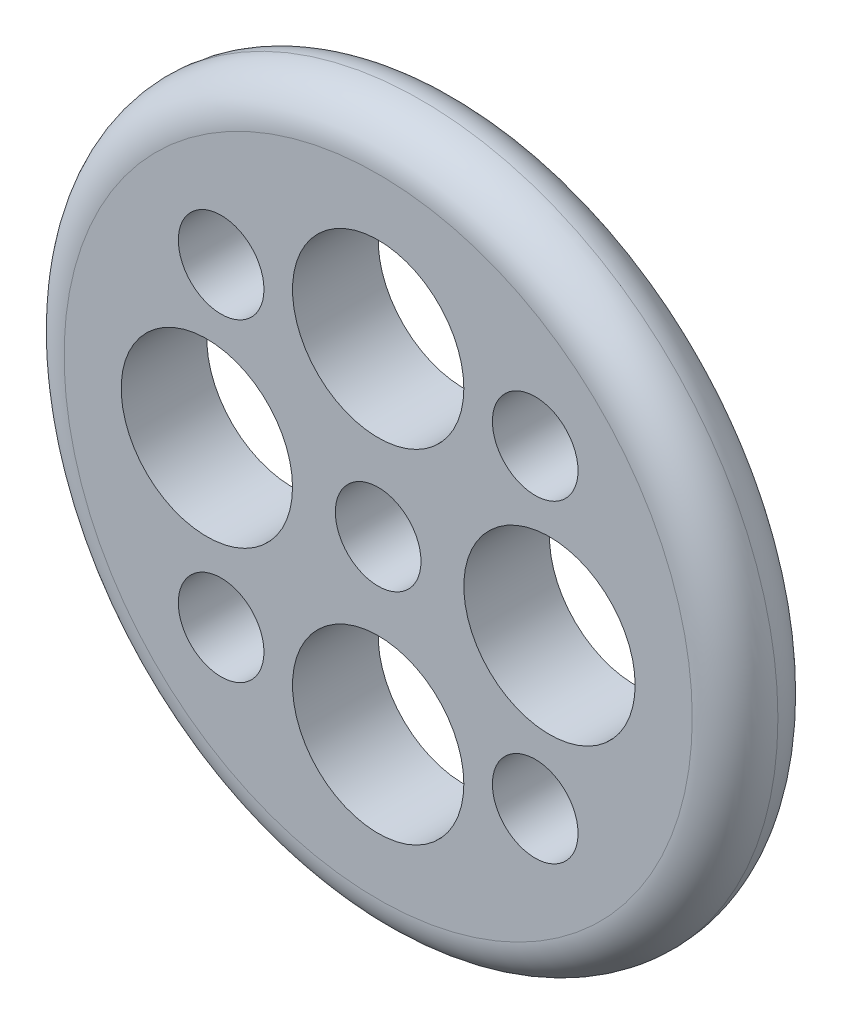
ISO-10303-21;
HEADER;
FILE_DESCRIPTION(('STEP AP214'),'2;1');
FILE_NAME('part.step','',(''),(''),'','','');
FILE_SCHEMA(('AUTOMOTIVE_DESIGN { 1 0 10303 214 1 1 1 1 }'));
ENDSEC;
DATA;
#1=APPLICATION_CONTEXT('core data for automotive mechanical design processes');
#2=APPLICATION_PROTOCOL_DEFINITION('international standard','automotive_design',2000,#1);
#3=PRODUCT_CONTEXT('',#1,'mechanical');
#4=PRODUCT('Part','Part','',(#3));
#5=PRODUCT_RELATED_PRODUCT_CATEGORY('part','',(#4));
#6=PRODUCT_DEFINITION_FORMATION('','',#4);
#7=PRODUCT_DEFINITION_CONTEXT('part definition',#1,'design');
#8=PRODUCT_DEFINITION('design','',#6,#7);
#9=PRODUCT_DEFINITION_SHAPE('','',#8);
#10=(LENGTH_UNIT() NAMED_UNIT(*) SI_UNIT(.MILLI.,.METRE.));
#11=(NAMED_UNIT(*) PLANE_ANGLE_UNIT() SI_UNIT($,.RADIAN.));
#12=(NAMED_UNIT(*) SI_UNIT($,.STERADIAN.) SOLID_ANGLE_UNIT());
#13=UNCERTAINTY_MEASURE_WITH_UNIT(LENGTH_MEASURE(1.E-05),#10,'distance_accuracy_value','');
#14=(GEOMETRIC_REPRESENTATION_CONTEXT(3) GLOBAL_UNCERTAINTY_ASSIGNED_CONTEXT((#13)) GLOBAL_UNIT_ASSIGNED_CONTEXT((#10,
#11,#12)) REPRESENTATION_CONTEXT('',''));
#15=CARTESIAN_POINT('',(0.,0.,0.));
#16=DIRECTION('',(0.,0.,1.));
#17=DIRECTION('',(1.,0.,0.));
#18=AXIS2_PLACEMENT_3D('',#15,#16,#17);
#19=CARTESIAN_POINT('',(0.,0.,30.));
#20=DIRECTION('',(0.,0.,1.));
#21=DIRECTION('',(1.,0.,0.));
#22=AXIS2_PLACEMENT_3D('',#19,#20,#21);
#23=PLANE('',#22);
#24=CARTESIAN_POINT('',(55.,-55.,30.));
#25=DIRECTION('',(0.,0.,1.));
#26=DIRECTION('',(1.,0.,0.));
#27=AXIS2_PLACEMENT_3D('',#24,#25,#26);
#28=CIRCLE('',#27,15.);
#29=CARTESIAN_POINT('',(70.,-55.,30.));
#30=VERTEX_POINT('',#29);
#31=EDGE_CURVE('E107',#30,#30,#28,.T.);
#32=ORIENTED_EDGE('',*,*,#31,.F.);
#33=EDGE_LOOP('',(#32));
#34=FACE_BOUND('',#33,.T.);
#35=CARTESIAN_POINT('',(60.,0.,30.));
#36=DIRECTION('',(0.,0.,1.));
#37=DIRECTION('',(1.,0.,0.));
#38=AXIS2_PLACEMENT_3D('',#35,#36,#37);
#39=CIRCLE('',#38,30.);
#40=CARTESIAN_POINT('',(90.,0.,30.));
#41=VERTEX_POINT('',#40);
#42=EDGE_CURVE('E106',#41,#41,#39,.T.);
#43=ORIENTED_EDGE('',*,*,#42,.F.);
#44=EDGE_LOOP('',(#43));
#45=FACE_BOUND('',#44,.T.);
#46=CARTESIAN_POINT('',(-60.,0.,30.));
#47=DIRECTION('',(0.,0.,1.));
#48=DIRECTION('',(1.,0.,0.));
#49=AXIS2_PLACEMENT_3D('',#46,#47,#48);
#50=CIRCLE('',#49,30.);
#51=CARTESIAN_POINT('',(-30.,0.,30.));
#52=VERTEX_POINT('',#51);
#53=EDGE_CURVE('E100',#52,#52,#50,.T.);
#54=ORIENTED_EDGE('',*,*,#53,.F.);
#55=EDGE_LOOP('',(#54));
#56=FACE_BOUND('',#55,.T.);
#57=CARTESIAN_POINT('',(0.,-60.,30.));
#58=DIRECTION('',(0.,0.,1.));
#59=DIRECTION('',(1.,0.,0.));
#60=AXIS2_PLACEMENT_3D('',#57,#58,#59);
#61=CIRCLE('',#60,30.);
#62=CARTESIAN_POINT('',(30.,-60.,30.));
#63=VERTEX_POINT('',#62);
#64=EDGE_CURVE('E103',#63,#63,#61,.T.);
#65=ORIENTED_EDGE('',*,*,#64,.F.);
#66=EDGE_LOOP('',(#65));
#67=FACE_BOUND('',#66,.T.);
#68=CARTESIAN_POINT('',(-55.,-55.,30.));
#69=DIRECTION('',(0.,0.,1.));
#70=DIRECTION('',(1.,0.,0.));
#71=AXIS2_PLACEMENT_3D('',#68,#69,#70);
#72=CIRCLE('',#71,15.);
#73=CARTESIAN_POINT('',(-40.,-55.,30.));
#74=VERTEX_POINT('',#73);
#75=EDGE_CURVE('E110',#74,#74,#72,.T.);
#76=ORIENTED_EDGE('',*,*,#75,.F.);
#77=EDGE_LOOP('',(#76));
#78=FACE_BOUND('',#77,.T.);
#79=CARTESIAN_POINT('',(-55.,55.,30.));
#80=DIRECTION('',(0.,0.,1.));
#81=DIRECTION('',(1.,0.,0.));
#82=AXIS2_PLACEMENT_3D('',#79,#80,#81);
#83=CIRCLE('',#82,15.);
#84=CARTESIAN_POINT('',(-40.,55.,30.));
#85=VERTEX_POINT('',#84);
#86=EDGE_CURVE('E116',#85,#85,#83,.T.);
#87=ORIENTED_EDGE('',*,*,#86,.F.);
#88=EDGE_LOOP('',(#87));
#89=FACE_BOUND('',#88,.T.);
#90=CARTESIAN_POINT('',(55.,55.,30.));
#91=DIRECTION('',(0.,0.,1.));
#92=DIRECTION('',(1.,0.,0.));
#93=AXIS2_PLACEMENT_3D('',#90,#91,#92);
#94=CIRCLE('',#93,15.);
#95=CARTESIAN_POINT('',(70.,55.,30.));
#96=VERTEX_POINT('',#95);
#97=EDGE_CURVE('E113',#96,#96,#94,.T.);
#98=ORIENTED_EDGE('',*,*,#97,.F.);
#99=EDGE_LOOP('',(#98));
#100=FACE_BOUND('',#99,.T.);
#101=CARTESIAN_POINT('',(0.,60.,30.));
#102=DIRECTION('',(0.,0.,1.));
#103=DIRECTION('',(1.,0.,0.));
#104=AXIS2_PLACEMENT_3D('',#101,#102,#103);
#105=CIRCLE('',#104,30.);
#106=CARTESIAN_POINT('',(30.,60.,30.));
#107=VERTEX_POINT('',#106);
#108=EDGE_CURVE('E70',#107,#107,#105,.T.);
#109=ORIENTED_EDGE('',*,*,#108,.F.);
#110=EDGE_LOOP('',(#109));
#111=FACE_BOUND('',#110,.T.);
#112=CARTESIAN_POINT('',(0.,0.,30.));
#113=DIRECTION('',(0.,0.,1.));
#114=DIRECTION('',(1.,0.,0.));
#115=AXIS2_PLACEMENT_3D('',#112,#113,#114);
#116=CIRCLE('',#115,15.);
#117=CARTESIAN_POINT('',(15.,0.,30.));
#118=VERTEX_POINT('',#117);
#119=EDGE_CURVE('E89',#118,#118,#116,.T.);
#120=ORIENTED_EDGE('',*,*,#119,.F.);
#121=EDGE_LOOP('',(#120));
#122=FACE_BOUND('',#121,.T.);
#123=CARTESIAN_POINT('',(0.,0.,30.));
#124=DIRECTION('',(0.,0.,1.));
#125=DIRECTION('',(1.,0.,0.));
#126=AXIS2_PLACEMENT_3D('',#123,#124,#125);
#127=CIRCLE('',#126,110.);
#128=CARTESIAN_POINT('',(110.,0.,30.));
#129=VERTEX_POINT('',#128);
#130=EDGE_CURVE('E10',#129,#129,#127,.T.);
#131=ORIENTED_EDGE('',*,*,#130,.T.);
#132=EDGE_LOOP('',(#131));
#133=FACE_BOUND('',#132,.T.);
#134=ADVANCED_FACE('F46',(#34,#45,#56,#67,#78,#89,#100,#111,#122,#133),#23,.T.);
#135=CARTESIAN_POINT('',(0.,0.,0.));
#136=DIRECTION('',(0.,0.,1.));
#137=DIRECTION('',(1.,0.,0.));
#138=AXIS2_PLACEMENT_3D('',#135,#136,#137);
#139=PLANE('',#138);
#140=CARTESIAN_POINT('',(55.,-55.,0.));
#141=DIRECTION('',(0.,0.,1.));
#142=DIRECTION('',(1.,0.,0.));
#143=AXIS2_PLACEMENT_3D('',#140,#141,#142);
#144=CIRCLE('',#143,15.);
#145=CARTESIAN_POINT('',(70.,-55.,0.));
#146=VERTEX_POINT('',#145);
#147=EDGE_CURVE('E50',#146,#146,#144,.T.);
#148=ORIENTED_EDGE('',*,*,#147,.T.);
#149=EDGE_LOOP('',(#148));
#150=FACE_BOUND('',#149,.T.);
#151=CARTESIAN_POINT('',(60.,0.,0.));
#152=DIRECTION('',(0.,0.,1.));
#153=DIRECTION('',(1.,0.,0.));
#154=AXIS2_PLACEMENT_3D('',#151,#152,#153);
#155=CIRCLE('',#154,30.);
#156=CARTESIAN_POINT('',(90.,0.,0.));
#157=VERTEX_POINT('',#156);
#158=EDGE_CURVE('E84',#157,#157,#155,.T.);
#159=ORIENTED_EDGE('',*,*,#158,.T.);
#160=EDGE_LOOP('',(#159));
#161=FACE_BOUND('',#160,.T.);
#162=CARTESIAN_POINT('',(-60.,0.,0.));
#163=DIRECTION('',(0.,0.,1.));
#164=DIRECTION('',(1.,0.,0.));
#165=AXIS2_PLACEMENT_3D('',#162,#163,#164);
#166=CIRCLE('',#165,30.);
#167=CARTESIAN_POINT('',(-30.,0.,0.));
#168=VERTEX_POINT('',#167);
#169=EDGE_CURVE('E82',#168,#168,#166,.T.);
#170=ORIENTED_EDGE('',*,*,#169,.T.);
#171=EDGE_LOOP('',(#170));
#172=FACE_BOUND('',#171,.T.);
#173=CARTESIAN_POINT('',(0.,-60.,0.));
#174=DIRECTION('',(0.,0.,1.));
#175=DIRECTION('',(1.,0.,0.));
#176=AXIS2_PLACEMENT_3D('',#173,#174,#175);
#177=CIRCLE('',#176,30.);
#178=CARTESIAN_POINT('',(30.,-60.,0.));
#179=VERTEX_POINT('',#178);
#180=EDGE_CURVE('E79',#179,#179,#177,.T.);
#181=ORIENTED_EDGE('',*,*,#180,.T.);
#182=EDGE_LOOP('',(#181));
#183=FACE_BOUND('',#182,.T.);
#184=CARTESIAN_POINT('',(-55.,-55.,0.));
#185=DIRECTION('',(0.,0.,1.));
#186=DIRECTION('',(1.,0.,0.));
#187=AXIS2_PLACEMENT_3D('',#184,#185,#186);
#188=CIRCLE('',#187,15.);
#189=CARTESIAN_POINT('',(-40.,-55.,0.));
#190=VERTEX_POINT('',#189);
#191=EDGE_CURVE('E76',#190,#190,#188,.T.);
#192=ORIENTED_EDGE('',*,*,#191,.T.);
#193=EDGE_LOOP('',(#192));
#194=FACE_BOUND('',#193,.T.);
#195=CARTESIAN_POINT('',(-55.,55.,0.));
#196=DIRECTION('',(0.,0.,1.));
#197=DIRECTION('',(1.,0.,0.));
#198=AXIS2_PLACEMENT_3D('',#195,#196,#197);
#199=CIRCLE('',#198,15.);
#200=CARTESIAN_POINT('',(-40.,55.,0.));
#201=VERTEX_POINT('',#200);
#202=EDGE_CURVE('E73',#201,#201,#199,.T.);
#203=ORIENTED_EDGE('',*,*,#202,.T.);
#204=EDGE_LOOP('',(#203));
#205=FACE_BOUND('',#204,.T.);
#206=CARTESIAN_POINT('',(55.,55.,0.));
#207=DIRECTION('',(0.,0.,1.));
#208=DIRECTION('',(1.,0.,0.));
#209=AXIS2_PLACEMENT_3D('',#206,#207,#208);
#210=CIRCLE('',#209,15.);
#211=CARTESIAN_POINT('',(70.,55.,0.));
#212=VERTEX_POINT('',#211);
#213=EDGE_CURVE('E69',#212,#212,#210,.T.);
#214=ORIENTED_EDGE('',*,*,#213,.T.);
#215=EDGE_LOOP('',(#214));
#216=FACE_BOUND('',#215,.T.);
#217=CARTESIAN_POINT('',(0.,60.,0.));
#218=DIRECTION('',(0.,0.,1.));
#219=DIRECTION('',(1.,0.,0.));
#220=AXIS2_PLACEMENT_3D('',#217,#218,#219);
#221=CIRCLE('',#220,30.);
#222=CARTESIAN_POINT('',(30.,60.,0.));
#223=VERTEX_POINT('',#222);
#224=EDGE_CURVE('E66',#223,#223,#221,.T.);
#225=ORIENTED_EDGE('',*,*,#224,.T.);
#226=EDGE_LOOP('',(#225));
#227=FACE_BOUND('',#226,.T.);
#228=CARTESIAN_POINT('',(0.,0.,0.));
#229=DIRECTION('',(0.,0.,1.));
#230=DIRECTION('',(1.,0.,0.));
#231=AXIS2_PLACEMENT_3D('',#228,#229,#230);
#232=CIRCLE('',#231,15.);
#233=CARTESIAN_POINT('',(15.,0.,0.));
#234=VERTEX_POINT('',#233);
#235=EDGE_CURVE('E65',#234,#234,#232,.T.);
#236=ORIENTED_EDGE('',*,*,#235,.T.);
#237=EDGE_LOOP('',(#236));
#238=FACE_BOUND('',#237,.T.);
#239=CARTESIAN_POINT('',(0.,0.,0.));
#240=DIRECTION('',(0.,0.,1.));
#241=DIRECTION('',(1.,0.,0.));
#242=AXIS2_PLACEMENT_3D('',#239,#240,#241);
#243=CIRCLE('',#242,110.);
#244=CARTESIAN_POINT('',(110.,0.,0.));
#245=VERTEX_POINT('',#244);
#246=EDGE_CURVE('E54',#245,#245,#243,.F.);
#247=ORIENTED_EDGE('',*,*,#246,.T.);
#248=EDGE_LOOP('',(#247));
#249=FACE_BOUND('',#248,.T.);
#250=ADVANCED_FACE('F127',(#150,#161,#172,#183,#194,#205,#216,#227,#238,#249),#139,.F.);
#251=CARTESIAN_POINT('',(0.,0.,15.));
#252=DIRECTION('',(0.,0.,1.));
#253=DIRECTION('',(1.,0.,0.));
#254=AXIS2_PLACEMENT_3D('',#251,#252,#253);
#255=TOROIDAL_SURFACE('',#254,110.,15.);
#256=ORIENTED_EDGE('',*,*,#130,.F.);
#257=EDGE_LOOP('',(#256));
#258=FACE_BOUND('',#257,.T.);
#259=CARTESIAN_POINT('',(0.,0.,15.));
#260=DIRECTION('',(0.,0.,1.));
#261=DIRECTION('',(1.,0.,0.));
#262=AXIS2_PLACEMENT_3D('',#259,#260,#261);
#263=CIRCLE('',#262,125.);
#264=CARTESIAN_POINT('',(125.,0.,15.));
#265=VERTEX_POINT('',#264);
#266=EDGE_CURVE('E59',#265,#265,#263,.F.);
#267=ORIENTED_EDGE('',*,*,#266,.F.);
#268=EDGE_LOOP('',(#267));
#269=FACE_BOUND('',#268,.T.);
#270=ADVANCED_FACE('F48',(#258,#269),#255,.T.);
#271=CARTESIAN_POINT('',(0.,0.,15.));
#272=DIRECTION('',(0.,0.,1.));
#273=DIRECTION('',(1.,0.,0.));
#274=AXIS2_PLACEMENT_3D('',#271,#272,#273);
#275=TOROIDAL_SURFACE('',#274,110.,15.);
#276=ORIENTED_EDGE('',*,*,#246,.F.);
#277=EDGE_LOOP('',(#276));
#278=FACE_BOUND('',#277,.T.);
#279=ORIENTED_EDGE('',*,*,#266,.T.);
#280=EDGE_LOOP('',(#279));
#281=FACE_BOUND('',#280,.T.);
#282=ADVANCED_FACE('F152',(#278,#281),#275,.T.);
#283=CARTESIAN_POINT('',(0.,0.,0.));
#284=DIRECTION('',(0.,0.,1.));
#285=DIRECTION('',(1.,0.,0.));
#286=AXIS2_PLACEMENT_3D('',#283,#284,#285);
#287=CYLINDRICAL_SURFACE('',#286,15.);
#288=ORIENTED_EDGE('',*,*,#235,.F.);
#289=EDGE_LOOP('',(#288));
#290=FACE_BOUND('',#289,.T.);
#291=ORIENTED_EDGE('',*,*,#119,.T.);
#292=EDGE_LOOP('',(#291));
#293=FACE_BOUND('',#292,.T.);
#294=ADVANCED_FACE('F141',(#290,#293),#287,.F.);
#295=CARTESIAN_POINT('',(0.,60.,-20.));
#296=DIRECTION('',(0.,0.,1.));
#297=DIRECTION('',(1.,0.,0.));
#298=AXIS2_PLACEMENT_3D('',#295,#296,#297);
#299=CYLINDRICAL_SURFACE('',#298,30.);
#300=ORIENTED_EDGE('',*,*,#108,.T.);
#301=EDGE_LOOP('',(#300));
#302=FACE_BOUND('',#301,.T.);
#303=ORIENTED_EDGE('',*,*,#224,.F.);
#304=EDGE_LOOP('',(#303));
#305=FACE_BOUND('',#304,.T.);
#306=ADVANCED_FACE('F137',(#302,#305),#299,.F.);
#307=CARTESIAN_POINT('',(55.,55.,-20.));
#308=DIRECTION('',(0.,0.,1.));
#309=DIRECTION('',(1.,0.,0.));
#310=AXIS2_PLACEMENT_3D('',#307,#308,#309);
#311=CYLINDRICAL_SURFACE('',#310,15.);
#312=ORIENTED_EDGE('',*,*,#97,.T.);
#313=EDGE_LOOP('',(#312));
#314=FACE_BOUND('',#313,.T.);
#315=ORIENTED_EDGE('',*,*,#213,.F.);
#316=EDGE_LOOP('',(#315));
#317=FACE_BOUND('',#316,.T.);
#318=ADVANCED_FACE('F140',(#314,#317),#311,.F.);
#319=CARTESIAN_POINT('',(-55.,55.,-20.));
#320=DIRECTION('',(0.,0.,1.));
#321=DIRECTION('',(1.,0.,0.));
#322=AXIS2_PLACEMENT_3D('',#319,#320,#321);
#323=CYLINDRICAL_SURFACE('',#322,15.);
#324=ORIENTED_EDGE('',*,*,#86,.T.);
#325=EDGE_LOOP('',(#324));
#326=FACE_BOUND('',#325,.T.);
#327=ORIENTED_EDGE('',*,*,#202,.F.);
#328=EDGE_LOOP('',(#327));
#329=FACE_BOUND('',#328,.T.);
#330=ADVANCED_FACE('F186',(#326,#329),#323,.F.);
#331=CARTESIAN_POINT('',(-55.,-55.,-20.));
#332=DIRECTION('',(0.,0.,1.));
#333=DIRECTION('',(1.,0.,0.));
#334=AXIS2_PLACEMENT_3D('',#331,#332,#333);
#335=CYLINDRICAL_SURFACE('',#334,15.);
#336=ORIENTED_EDGE('',*,*,#75,.T.);
#337=EDGE_LOOP('',(#336));
#338=FACE_BOUND('',#337,.T.);
#339=ORIENTED_EDGE('',*,*,#191,.F.);
#340=EDGE_LOOP('',(#339));
#341=FACE_BOUND('',#340,.T.);
#342=ADVANCED_FACE('F122',(#338,#341),#335,.F.);
#343=CARTESIAN_POINT('',(0.,-60.,-20.));
#344=DIRECTION('',(0.,0.,1.));
#345=DIRECTION('',(1.,0.,0.));
#346=AXIS2_PLACEMENT_3D('',#343,#344,#345);
#347=CYLINDRICAL_SURFACE('',#346,30.);
#348=ORIENTED_EDGE('',*,*,#64,.T.);
#349=EDGE_LOOP('',(#348));
#350=FACE_BOUND('',#349,.T.);
#351=ORIENTED_EDGE('',*,*,#180,.F.);
#352=EDGE_LOOP('',(#351));
#353=FACE_BOUND('',#352,.T.);
#354=ADVANCED_FACE('F201',(#350,#353),#347,.F.);
#355=CARTESIAN_POINT('',(-60.,0.,-20.));
#356=DIRECTION('',(0.,0.,1.));
#357=DIRECTION('',(1.,0.,0.));
#358=AXIS2_PLACEMENT_3D('',#355,#356,#357);
#359=CYLINDRICAL_SURFACE('',#358,30.);
#360=ORIENTED_EDGE('',*,*,#53,.T.);
#361=EDGE_LOOP('',(#360));
#362=FACE_BOUND('',#361,.T.);
#363=ORIENTED_EDGE('',*,*,#169,.F.);
#364=EDGE_LOOP('',(#363));
#365=FACE_BOUND('',#364,.T.);
#366=ADVANCED_FACE('F208',(#362,#365),#359,.F.);
#367=CARTESIAN_POINT('',(60.,0.,-20.));
#368=DIRECTION('',(0.,0.,1.));
#369=DIRECTION('',(1.,0.,0.));
#370=AXIS2_PLACEMENT_3D('',#367,#368,#369);
#371=CYLINDRICAL_SURFACE('',#370,30.);
#372=ORIENTED_EDGE('',*,*,#42,.T.);
#373=EDGE_LOOP('',(#372));
#374=FACE_BOUND('',#373,.T.);
#375=ORIENTED_EDGE('',*,*,#158,.F.);
#376=EDGE_LOOP('',(#375));
#377=FACE_BOUND('',#376,.T.);
#378=ADVANCED_FACE('F216',(#374,#377),#371,.F.);
#379=CARTESIAN_POINT('',(55.,-55.,-20.));
#380=DIRECTION('',(0.,0.,1.));
#381=DIRECTION('',(1.,0.,0.));
#382=AXIS2_PLACEMENT_3D('',#379,#380,#381);
#383=CYLINDRICAL_SURFACE('',#382,15.);
#384=ORIENTED_EDGE('',*,*,#31,.T.);
#385=EDGE_LOOP('',(#384));
#386=FACE_BOUND('',#385,.T.);
#387=ORIENTED_EDGE('',*,*,#147,.F.);
#388=EDGE_LOOP('',(#387));
#389=FACE_BOUND('',#388,.T.);
#390=ADVANCED_FACE('F224',(#386,#389),#383,.F.);
#391=CLOSED_SHELL('',(#134,#250,#270,#282,#294,#306,#318,#330,#342,#354,#366,#378,#390));
#392=MANIFOLD_SOLID_BREP('B2',#391);
#393=ADVANCED_BREP_SHAPE_REPRESENTATION('',(#18,#392),#14);
#394=SHAPE_DEFINITION_REPRESENTATION(#9,#393);
ENDSEC;
END-ISO-10303-21;
